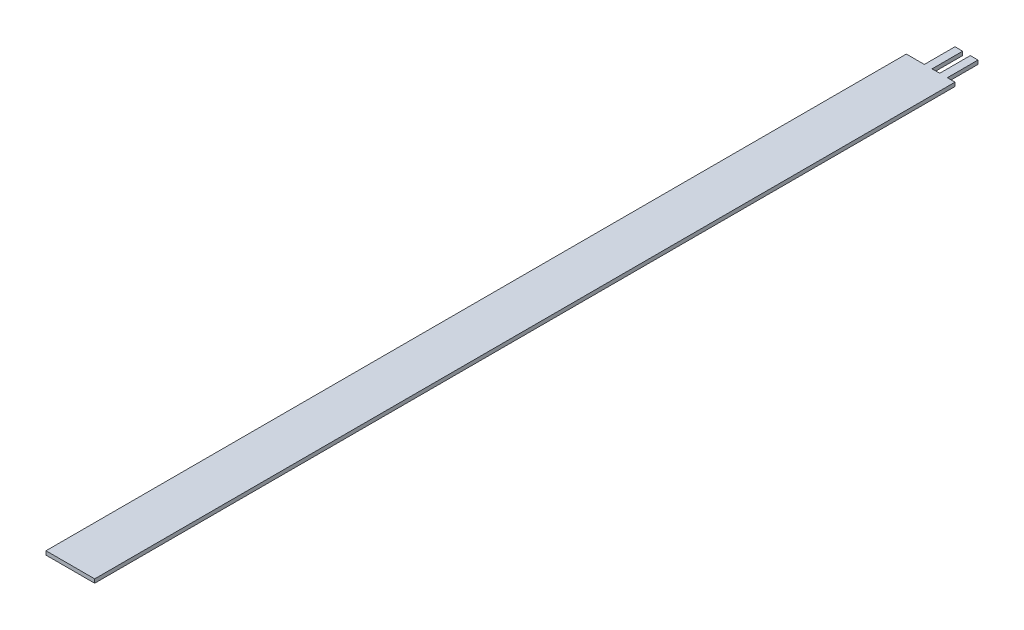
ISO-10303-21;
HEADER;
FILE_DESCRIPTION(('STEP AP214'),'2;1');
FILE_NAME('part.step','',(''),(''),'','','');
FILE_SCHEMA(('AUTOMOTIVE_DESIGN { 1 0 10303 214 1 1 1 1 }'));
ENDSEC;
DATA;
#1=APPLICATION_CONTEXT('core data for automotive mechanical design processes');
#2=APPLICATION_PROTOCOL_DEFINITION('international standard','automotive_design',2000,#1);
#3=PRODUCT_CONTEXT('',#1,'mechanical');
#4=PRODUCT('Part','Part','',(#3));
#5=PRODUCT_RELATED_PRODUCT_CATEGORY('part','',(#4));
#6=PRODUCT_DEFINITION_FORMATION('','',#4);
#7=PRODUCT_DEFINITION_CONTEXT('part definition',#1,'design');
#8=PRODUCT_DEFINITION('design','',#6,#7);
#9=PRODUCT_DEFINITION_SHAPE('','',#8);
#10=(LENGTH_UNIT() NAMED_UNIT(*) SI_UNIT(.MILLI.,.METRE.));
#11=(NAMED_UNIT(*) PLANE_ANGLE_UNIT() SI_UNIT($,.RADIAN.));
#12=(NAMED_UNIT(*) SI_UNIT($,.STERADIAN.) SOLID_ANGLE_UNIT());
#13=UNCERTAINTY_MEASURE_WITH_UNIT(LENGTH_MEASURE(1.E-05),#10,'distance_accuracy_value','');
#14=(GEOMETRIC_REPRESENTATION_CONTEXT(3) GLOBAL_UNCERTAINTY_ASSIGNED_CONTEXT((#13)) GLOBAL_UNIT_ASSIGNED_CONTEXT((#10,
#11,#12)) REPRESENTATION_CONTEXT('',''));
#15=CARTESIAN_POINT('',(0.,0.,0.));
#16=DIRECTION('',(0.,0.,1.));
#17=DIRECTION('',(1.,0.,0.));
#18=AXIS2_PLACEMENT_3D('',#15,#16,#17);
#19=CARTESIAN_POINT('',(6.35,0.5,0.));
#20=DIRECTION('',(0.,0.,1.));
#21=DIRECTION('',(1.,0.,0.));
#22=AXIS2_PLACEMENT_3D('',#19,#20,#21);
#23=PLANE('',#22);
#24=DIRECTION('',(0.,-1.,0.));
#25=VECTOR('',#24,1.);
#26=CARTESIAN_POINT('',(5.35,0.,0.));
#27=LINE('',#26,#25);
#28=CARTESIAN_POINT('',(5.35,0.5,0.));
#29=VERTEX_POINT('',#28);
#30=CARTESIAN_POINT('',(5.35,0.,0.));
#31=VERTEX_POINT('',#30);
#32=EDGE_CURVE('E69',#29,#31,#27,.T.);
#33=ORIENTED_EDGE('',*,*,#32,.F.);
#34=DIRECTION('',(-1.,0.,0.));
#35=VECTOR('',#34,1.);
#36=CARTESIAN_POINT('',(6.35,0.5,0.));
#37=LINE('',#36,#35);
#38=CARTESIAN_POINT('',(6.35,0.5,0.));
#39=VERTEX_POINT('',#38);
#40=EDGE_CURVE('E218',#39,#29,#37,.T.);
#41=ORIENTED_EDGE('',*,*,#40,.F.);
#42=DIRECTION('',(0.,-1.,0.));
#43=VECTOR('',#42,1.);
#44=CARTESIAN_POINT('',(6.35,0.5,0.));
#45=LINE('',#44,#43);
#46=CARTESIAN_POINT('',(6.35,0.,0.));
#47=VERTEX_POINT('',#46);
#48=EDGE_CURVE('E231',#39,#47,#45,.T.);
#49=ORIENTED_EDGE('',*,*,#48,.T.);
#50=DIRECTION('',(-1.,0.,0.));
#51=VECTOR('',#50,1.);
#52=CARTESIAN_POINT('',(6.35,0.,0.));
#53=LINE('',#52,#51);
#54=EDGE_CURVE('E232',#47,#31,#53,.T.);
#55=ORIENTED_EDGE('',*,*,#54,.T.);
#56=EDGE_LOOP('',(#33,#41,#49,#55));
#57=FACE_BOUND('',#56,.T.);
#58=ADVANCED_FACE('F45',(#57),#23,.F.);
#59=CARTESIAN_POINT('',(4.35,0.5,0.));
#60=VERTEX_POINT('',#59);
#61=CARTESIAN_POINT('',(3.35,0.5,0.));
#62=VERTEX_POINT('',#61);
#63=EDGE_CURVE('E61',#60,#62,#37,.T.);
#64=ORIENTED_EDGE('',*,*,#63,.F.);
#65=DIRECTION('',(0.,-1.,0.));
#66=VECTOR('',#65,1.);
#67=CARTESIAN_POINT('',(4.35,0.,0.));
#68=LINE('',#67,#66);
#69=CARTESIAN_POINT('',(4.35,0.,0.));
#70=VERTEX_POINT('',#69);
#71=EDGE_CURVE('E143',#60,#70,#68,.T.);
#72=ORIENTED_EDGE('',*,*,#71,.T.);
#73=CARTESIAN_POINT('',(3.35,0.,0.));
#74=VERTEX_POINT('',#73);
#75=EDGE_CURVE('E236',#70,#74,#53,.T.);
#76=ORIENTED_EDGE('',*,*,#75,.T.);
#77=DIRECTION('',(0.,-1.,0.));
#78=VECTOR('',#77,1.);
#79=CARTESIAN_POINT('',(3.35,0.,0.));
#80=LINE('',#79,#78);
#81=EDGE_CURVE('E187',#62,#74,#80,.T.);
#82=ORIENTED_EDGE('',*,*,#81,.F.);
#83=EDGE_LOOP('',(#64,#72,#76,#82));
#84=FACE_BOUND('',#83,.T.);
#85=ADVANCED_FACE('F277',(#84),#23,.F.);
#86=CARTESIAN_POINT('',(2.35,0.5,0.));
#87=VERTEX_POINT('',#86);
#88=CARTESIAN_POINT('',(0.,0.5,0.));
#89=VERTEX_POINT('',#88);
#90=EDGE_CURVE('E222',#87,#89,#37,.T.);
#91=ORIENTED_EDGE('',*,*,#90,.F.);
#92=DIRECTION('',(0.,-1.,0.));
#93=VECTOR('',#92,1.);
#94=CARTESIAN_POINT('',(2.35,0.,0.));
#95=LINE('',#94,#93);
#96=CARTESIAN_POINT('',(2.35,0.,0.));
#97=VERTEX_POINT('',#96);
#98=EDGE_CURVE('E146',#87,#97,#95,.T.);
#99=ORIENTED_EDGE('',*,*,#98,.T.);
#100=CARTESIAN_POINT('',(0.,0.,0.));
#101=VERTEX_POINT('',#100);
#102=EDGE_CURVE('E217',#97,#101,#53,.T.);
#103=ORIENTED_EDGE('',*,*,#102,.T.);
#104=DIRECTION('',(0.,-1.,0.));
#105=VECTOR('',#104,1.);
#106=CARTESIAN_POINT('',(0.,0.5,0.));
#107=LINE('',#106,#105);
#108=EDGE_CURVE('E11',#89,#101,#107,.T.);
#109=ORIENTED_EDGE('',*,*,#108,.F.);
#110=EDGE_LOOP('',(#91,#99,#103,#109));
#111=FACE_BOUND('',#110,.T.);
#112=ADVANCED_FACE('F47',(#111),#23,.F.);
#113=CARTESIAN_POINT('',(0.,0.5,0.));
#114=DIRECTION('',(1.,0.,0.));
#115=DIRECTION('',(0.,0.,-1.));
#116=AXIS2_PLACEMENT_3D('',#113,#114,#115);
#117=PLANE('',#116);
#118=DIRECTION('',(0.,0.,1.));
#119=VECTOR('',#118,1.);
#120=CARTESIAN_POINT('',(0.,0.,0.));
#121=LINE('',#120,#119);
#122=CARTESIAN_POINT('',(0.,0.,112.24));
#123=VERTEX_POINT('',#122);
#124=EDGE_CURVE('E235',#101,#123,#121,.T.);
#125=ORIENTED_EDGE('',*,*,#124,.T.);
#126=DIRECTION('',(0.,-1.,0.));
#127=VECTOR('',#126,1.);
#128=CARTESIAN_POINT('',(0.,0.5,112.24));
#129=LINE('',#128,#127);
#130=CARTESIAN_POINT('',(0.,0.5,112.24));
#131=VERTEX_POINT('',#130);
#132=EDGE_CURVE('E54',#131,#123,#129,.T.);
#133=ORIENTED_EDGE('',*,*,#132,.F.);
#134=DIRECTION('',(0.,0.,1.));
#135=VECTOR('',#134,1.);
#136=CARTESIAN_POINT('',(0.,0.5,0.));
#137=LINE('',#136,#135);
#138=EDGE_CURVE('E221',#89,#131,#137,.T.);
#139=ORIENTED_EDGE('',*,*,#138,.F.);
#140=ORIENTED_EDGE('',*,*,#108,.T.);
#141=EDGE_LOOP('',(#125,#133,#139,#140));
#142=FACE_BOUND('',#141,.T.);
#143=ADVANCED_FACE('F283',(#142),#117,.F.);
#144=CARTESIAN_POINT('',(0.,0.5,112.24));
#145=DIRECTION('',(0.,0.,-1.));
#146=DIRECTION('',(-1.,0.,0.));
#147=AXIS2_PLACEMENT_3D('',#144,#145,#146);
#148=PLANE('',#147);
#149=DIRECTION('',(1.,0.,0.));
#150=VECTOR('',#149,1.);
#151=CARTESIAN_POINT('',(0.,0.,112.24));
#152=LINE('',#151,#150);
#153=CARTESIAN_POINT('',(6.35,0.,112.24));
#154=VERTEX_POINT('',#153);
#155=EDGE_CURVE('E239',#123,#154,#152,.T.);
#156=ORIENTED_EDGE('',*,*,#155,.T.);
#157=DIRECTION('',(0.,-1.,0.));
#158=VECTOR('',#157,1.);
#159=CARTESIAN_POINT('',(6.35,0.5,112.24));
#160=LINE('',#159,#158);
#161=CARTESIAN_POINT('',(6.35,0.5,112.24));
#162=VERTEX_POINT('',#161);
#163=EDGE_CURVE('E248',#162,#154,#160,.T.);
#164=ORIENTED_EDGE('',*,*,#163,.F.);
#165=DIRECTION('',(1.,0.,0.));
#166=VECTOR('',#165,1.);
#167=CARTESIAN_POINT('',(0.,0.5,112.24));
#168=LINE('',#167,#166);
#169=EDGE_CURVE('E225',#131,#162,#168,.T.);
#170=ORIENTED_EDGE('',*,*,#169,.F.);
#171=ORIENTED_EDGE('',*,*,#132,.T.);
#172=EDGE_LOOP('',(#156,#164,#170,#171));
#173=FACE_BOUND('',#172,.T.);
#174=ADVANCED_FACE('F257',(#173),#148,.F.);
#175=CARTESIAN_POINT('',(6.35,0.5,112.24));
#176=DIRECTION('',(-1.,0.,0.));
#177=DIRECTION('',(0.,0.,1.));
#178=AXIS2_PLACEMENT_3D('',#175,#176,#177);
#179=PLANE('',#178);
#180=DIRECTION('',(0.,0.,-1.));
#181=VECTOR('',#180,1.);
#182=CARTESIAN_POINT('',(6.35,0.,112.24));
#183=LINE('',#182,#181);
#184=EDGE_CURVE('E242',#154,#47,#183,.T.);
#185=ORIENTED_EDGE('',*,*,#184,.T.);
#186=ORIENTED_EDGE('',*,*,#48,.F.);
#187=DIRECTION('',(0.,0.,-1.));
#188=VECTOR('',#187,1.);
#189=CARTESIAN_POINT('',(6.35,0.5,112.24));
#190=LINE('',#189,#188);
#191=EDGE_CURVE('E228',#162,#39,#190,.T.);
#192=ORIENTED_EDGE('',*,*,#191,.F.);
#193=ORIENTED_EDGE('',*,*,#163,.T.);
#194=EDGE_LOOP('',(#185,#186,#192,#193));
#195=FACE_BOUND('',#194,.T.);
#196=ADVANCED_FACE('F269',(#195),#179,.F.);
#197=CARTESIAN_POINT('',(0.,0.5,0.));
#198=DIRECTION('',(0.,1.,0.));
#199=DIRECTION('',(0.,0.,1.));
#200=AXIS2_PLACEMENT_3D('',#197,#198,#199);
#201=PLANE('',#200);
#202=ORIENTED_EDGE('',*,*,#40,.T.);
#203=DIRECTION('',(0.,0.,1.));
#204=VECTOR('',#203,1.);
#205=CARTESIAN_POINT('',(5.35,0.5,-4.));
#206=LINE('',#205,#204);
#207=CARTESIAN_POINT('',(5.35,0.5,-4.));
#208=VERTEX_POINT('',#207);
#209=EDGE_CURVE('E147',#208,#29,#206,.T.);
#210=ORIENTED_EDGE('',*,*,#209,.F.);
#211=DIRECTION('',(1.,0.,0.));
#212=VECTOR('',#211,1.);
#213=CARTESIAN_POINT('',(0.,0.5,-4.));
#214=LINE('',#213,#212);
#215=CARTESIAN_POINT('',(4.35,0.5,-4.));
#216=VERTEX_POINT('',#215);
#217=EDGE_CURVE('E150',#216,#208,#214,.T.);
#218=ORIENTED_EDGE('',*,*,#217,.F.);
#219=DIRECTION('',(0.,0.,1.));
#220=VECTOR('',#219,1.);
#221=CARTESIAN_POINT('',(4.35,0.5,-4.));
#222=LINE('',#221,#220);
#223=EDGE_CURVE('E137',#216,#60,#222,.T.);
#224=ORIENTED_EDGE('',*,*,#223,.T.);
#225=ORIENTED_EDGE('',*,*,#63,.T.);
#226=DIRECTION('',(0.,0.,1.));
#227=VECTOR('',#226,1.);
#228=CARTESIAN_POINT('',(3.35,0.5,-4.));
#229=LINE('',#228,#227);
#230=CARTESIAN_POINT('',(3.35,0.5,-4.));
#231=VERTEX_POINT('',#230);
#232=EDGE_CURVE('E209',#231,#62,#229,.T.);
#233=ORIENTED_EDGE('',*,*,#232,.F.);
#234=DIRECTION('',(1.,0.,0.));
#235=VECTOR('',#234,1.);
#236=CARTESIAN_POINT('',(0.,0.5,-4.));
#237=LINE('',#236,#235);
#238=CARTESIAN_POINT('',(2.35,0.5,-4.));
#239=VERTEX_POINT('',#238);
#240=EDGE_CURVE('E186',#239,#231,#237,.T.);
#241=ORIENTED_EDGE('',*,*,#240,.F.);
#242=DIRECTION('',(0.,0.,1.));
#243=VECTOR('',#242,1.);
#244=CARTESIAN_POINT('',(2.35,0.5,-4.));
#245=LINE('',#244,#243);
#246=EDGE_CURVE('E213',#239,#87,#245,.T.);
#247=ORIENTED_EDGE('',*,*,#246,.T.);
#248=ORIENTED_EDGE('',*,*,#90,.T.);
#249=ORIENTED_EDGE('',*,*,#138,.T.);
#250=ORIENTED_EDGE('',*,*,#169,.T.);
#251=ORIENTED_EDGE('',*,*,#191,.T.);
#252=EDGE_LOOP('',(#202,#210,#218,#224,#225,#233,#241,#247,#248,#249,#250,#251));
#253=FACE_BOUND('',#252,.T.);
#254=ADVANCED_FACE('F151',(#253),#201,.T.);
#255=CARTESIAN_POINT('',(0.,0.,0.));
#256=DIRECTION('',(0.,1.,0.));
#257=DIRECTION('',(0.,0.,1.));
#258=AXIS2_PLACEMENT_3D('',#255,#256,#257);
#259=PLANE('',#258);
#260=ORIENTED_EDGE('',*,*,#54,.F.);
#261=ORIENTED_EDGE('',*,*,#184,.F.);
#262=ORIENTED_EDGE('',*,*,#155,.F.);
#263=ORIENTED_EDGE('',*,*,#124,.F.);
#264=ORIENTED_EDGE('',*,*,#102,.F.);
#265=DIRECTION('',(0.,0.,1.));
#266=VECTOR('',#265,1.);
#267=CARTESIAN_POINT('',(2.35,0.,-4.));
#268=LINE('',#267,#266);
#269=CARTESIAN_POINT('',(2.35,0.,-4.));
#270=VERTEX_POINT('',#269);
#271=EDGE_CURVE('E196',#270,#97,#268,.T.);
#272=ORIENTED_EDGE('',*,*,#271,.F.);
#273=DIRECTION('',(-1.,0.,0.));
#274=VECTOR('',#273,1.);
#275=CARTESIAN_POINT('',(0.,0.,-4.));
#276=LINE('',#275,#274);
#277=CARTESIAN_POINT('',(3.35,0.,-4.));
#278=VERTEX_POINT('',#277);
#279=EDGE_CURVE('E193',#278,#270,#276,.T.);
#280=ORIENTED_EDGE('',*,*,#279,.F.);
#281=DIRECTION('',(0.,0.,1.));
#282=VECTOR('',#281,1.);
#283=CARTESIAN_POINT('',(3.35,0.,-4.));
#284=LINE('',#283,#282);
#285=EDGE_CURVE('E205',#278,#74,#284,.T.);
#286=ORIENTED_EDGE('',*,*,#285,.T.);
#287=ORIENTED_EDGE('',*,*,#75,.F.);
#288=DIRECTION('',(0.,0.,1.));
#289=VECTOR('',#288,1.);
#290=CARTESIAN_POINT('',(4.35,0.,-4.));
#291=LINE('',#290,#289);
#292=CARTESIAN_POINT('',(4.35,0.,-4.));
#293=VERTEX_POINT('',#292);
#294=EDGE_CURVE('E171',#293,#70,#291,.T.);
#295=ORIENTED_EDGE('',*,*,#294,.F.);
#296=DIRECTION('',(-1.,0.,0.));
#297=VECTOR('',#296,1.);
#298=CARTESIAN_POINT('',(0.,0.,-4.));
#299=LINE('',#298,#297);
#300=CARTESIAN_POINT('',(5.35,0.,-4.));
#301=VERTEX_POINT('',#300);
#302=EDGE_CURVE('E160',#301,#293,#299,.T.);
#303=ORIENTED_EDGE('',*,*,#302,.F.);
#304=DIRECTION('',(0.,0.,1.));
#305=VECTOR('',#304,1.);
#306=CARTESIAN_POINT('',(5.35,0.,-4.));
#307=LINE('',#306,#305);
#308=EDGE_CURVE('E176',#301,#31,#307,.T.);
#309=ORIENTED_EDGE('',*,*,#308,.T.);
#310=EDGE_LOOP('',(#260,#261,#262,#263,#264,#272,#280,#286,#287,#295,#303,#309));
#311=FACE_BOUND('',#310,.T.);
#312=ADVANCED_FACE('F265',(#311),#259,.F.);
#313=CARTESIAN_POINT('',(2.35,0.,-4.));
#314=DIRECTION('',(-1.,0.,0.));
#315=DIRECTION('',(0.,0.,1.));
#316=AXIS2_PLACEMENT_3D('',#313,#314,#315);
#317=PLANE('',#316);
#318=ORIENTED_EDGE('',*,*,#98,.F.);
#319=ORIENTED_EDGE('',*,*,#246,.F.);
#320=DIRECTION('',(0.,-1.,0.));
#321=VECTOR('',#320,1.);
#322=CARTESIAN_POINT('',(2.35,0.,-4.));
#323=LINE('',#322,#321);
#324=EDGE_CURVE('E182',#239,#270,#323,.T.);
#325=ORIENTED_EDGE('',*,*,#324,.T.);
#326=ORIENTED_EDGE('',*,*,#271,.T.);
#327=EDGE_LOOP('',(#318,#319,#325,#326));
#328=FACE_BOUND('',#327,.T.);
#329=ADVANCED_FACE('F327',(#328),#317,.T.);
#330=CARTESIAN_POINT('',(3.35,0.,-4.));
#331=DIRECTION('',(-1.,0.,0.));
#332=DIRECTION('',(0.,0.,1.));
#333=AXIS2_PLACEMENT_3D('',#330,#331,#332);
#334=PLANE('',#333);
#335=ORIENTED_EDGE('',*,*,#81,.T.);
#336=ORIENTED_EDGE('',*,*,#285,.F.);
#337=DIRECTION('',(0.,-1.,0.));
#338=VECTOR('',#337,1.);
#339=CARTESIAN_POINT('',(3.35,0.,-4.));
#340=LINE('',#339,#338);
#341=EDGE_CURVE('E190',#231,#278,#340,.T.);
#342=ORIENTED_EDGE('',*,*,#341,.F.);
#343=ORIENTED_EDGE('',*,*,#232,.T.);
#344=EDGE_LOOP('',(#335,#336,#342,#343));
#345=FACE_BOUND('',#344,.T.);
#346=ADVANCED_FACE('F337',(#345),#334,.F.);
#347=CARTESIAN_POINT('',(0.,0.,-4.));
#348=DIRECTION('',(0.,0.,-1.));
#349=DIRECTION('',(-1.,0.,0.));
#350=AXIS2_PLACEMENT_3D('',#347,#348,#349);
#351=PLANE('',#350);
#352=ORIENTED_EDGE('',*,*,#324,.F.);
#353=ORIENTED_EDGE('',*,*,#240,.T.);
#354=ORIENTED_EDGE('',*,*,#341,.T.);
#355=ORIENTED_EDGE('',*,*,#279,.T.);
#356=EDGE_LOOP('',(#352,#353,#354,#355));
#357=FACE_BOUND('',#356,.T.);
#358=ADVANCED_FACE('F348',(#357),#351,.T.);
#359=CARTESIAN_POINT('',(4.35,0.,-4.));
#360=DIRECTION('',(-1.,0.,0.));
#361=DIRECTION('',(0.,0.,1.));
#362=AXIS2_PLACEMENT_3D('',#359,#360,#361);
#363=PLANE('',#362);
#364=ORIENTED_EDGE('',*,*,#71,.F.);
#365=ORIENTED_EDGE('',*,*,#223,.F.);
#366=DIRECTION('',(0.,-1.,0.));
#367=VECTOR('',#366,1.);
#368=CARTESIAN_POINT('',(4.35,0.,-4.));
#369=LINE('',#368,#367);
#370=EDGE_CURVE('E142',#216,#293,#369,.T.);
#371=ORIENTED_EDGE('',*,*,#370,.T.);
#372=ORIENTED_EDGE('',*,*,#294,.T.);
#373=EDGE_LOOP('',(#364,#365,#371,#372));
#374=FACE_BOUND('',#373,.T.);
#375=ADVANCED_FACE('F139',(#374),#363,.T.);
#376=CARTESIAN_POINT('',(5.35,0.,-4.));
#377=DIRECTION('',(-1.,0.,0.));
#378=DIRECTION('',(0.,0.,1.));
#379=AXIS2_PLACEMENT_3D('',#376,#377,#378);
#380=PLANE('',#379);
#381=ORIENTED_EDGE('',*,*,#32,.T.);
#382=ORIENTED_EDGE('',*,*,#308,.F.);
#383=DIRECTION('',(0.,-1.,0.));
#384=VECTOR('',#383,1.);
#385=CARTESIAN_POINT('',(5.35,0.,-4.));
#386=LINE('',#385,#384);
#387=EDGE_CURVE('E156',#208,#301,#386,.T.);
#388=ORIENTED_EDGE('',*,*,#387,.F.);
#389=ORIENTED_EDGE('',*,*,#209,.T.);
#390=EDGE_LOOP('',(#381,#382,#388,#389));
#391=FACE_BOUND('',#390,.T.);
#392=ADVANCED_FACE('F272',(#391),#380,.F.);
#393=CARTESIAN_POINT('',(0.,0.,-4.));
#394=DIRECTION('',(0.,0.,-1.));
#395=DIRECTION('',(-1.,0.,0.));
#396=AXIS2_PLACEMENT_3D('',#393,#394,#395);
#397=PLANE('',#396);
#398=ORIENTED_EDGE('',*,*,#370,.F.);
#399=ORIENTED_EDGE('',*,*,#217,.T.);
#400=ORIENTED_EDGE('',*,*,#387,.T.);
#401=ORIENTED_EDGE('',*,*,#302,.T.);
#402=EDGE_LOOP('',(#398,#399,#400,#401));
#403=FACE_BOUND('',#402,.T.);
#404=ADVANCED_FACE('F158',(#403),#397,.T.);
#405=CLOSED_SHELL('',(#58,#85,#112,#143,#174,#196,#254,#312,#329,#346,#358,#375,#392,#404));
#406=MANIFOLD_SOLID_BREP('B2',#405);
#407=ADVANCED_BREP_SHAPE_REPRESENTATION('',(#18,#406),#14);
#408=SHAPE_DEFINITION_REPRESENTATION(#9,#407);
ENDSEC;
END-ISO-10303-21;
